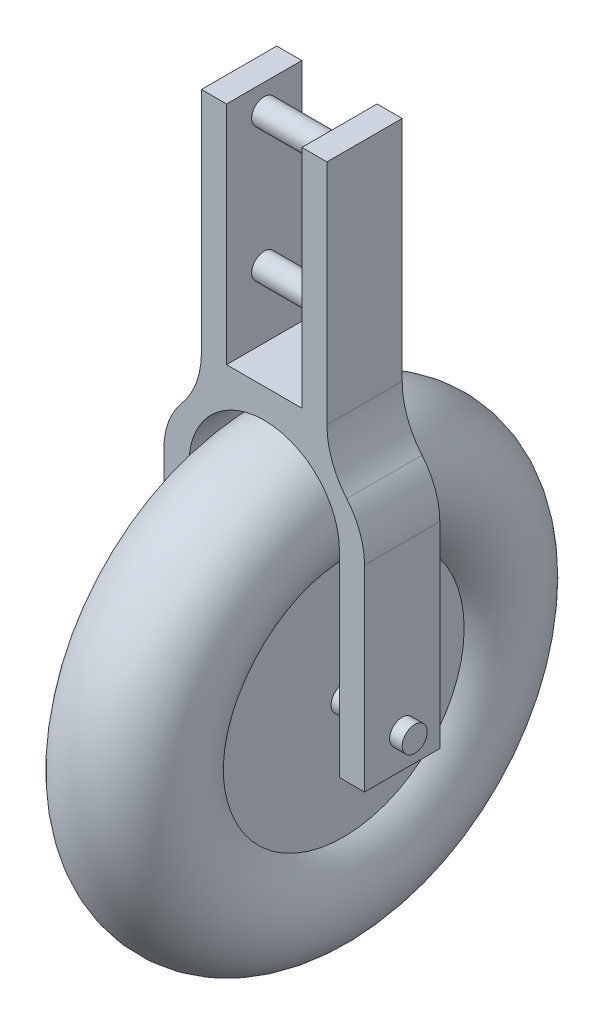
ISO-10303-21;
HEADER;
FILE_DESCRIPTION(('STEP AP214'),'2;1');
FILE_NAME('part.step','',(''),(''),'','','');
FILE_SCHEMA(('AUTOMOTIVE_DESIGN { 1 0 10303 214 1 1 1 1 }'));
ENDSEC;
DATA;
#1=APPLICATION_CONTEXT('core data for automotive mechanical design processes');
#2=APPLICATION_PROTOCOL_DEFINITION('international standard','automotive_design',2000,#1);
#3=PRODUCT_CONTEXT('',#1,'mechanical');
#4=PRODUCT('Part','Part','',(#3));
#5=PRODUCT_RELATED_PRODUCT_CATEGORY('part','',(#4));
#6=PRODUCT_DEFINITION_FORMATION('','',#4);
#7=PRODUCT_DEFINITION_CONTEXT('part definition',#1,'design');
#8=PRODUCT_DEFINITION('design','',#6,#7);
#9=PRODUCT_DEFINITION_SHAPE('','',#8);
#10=(LENGTH_UNIT() NAMED_UNIT(*) SI_UNIT(.MILLI.,.METRE.));
#11=(NAMED_UNIT(*) PLANE_ANGLE_UNIT() SI_UNIT($,.RADIAN.));
#12=(NAMED_UNIT(*) SI_UNIT($,.STERADIAN.) SOLID_ANGLE_UNIT());
#13=UNCERTAINTY_MEASURE_WITH_UNIT(LENGTH_MEASURE(1.E-05),#10,'distance_accuracy_value','');
#14=(GEOMETRIC_REPRESENTATION_CONTEXT(3) GLOBAL_UNCERTAINTY_ASSIGNED_CONTEXT((#13)) GLOBAL_UNIT_ASSIGNED_CONTEXT((#10,
#11,#12)) REPRESENTATION_CONTEXT('',''));
#15=CARTESIAN_POINT('',(0.,0.,0.));
#16=DIRECTION('',(0.,0.,1.));
#17=DIRECTION('',(1.,0.,0.));
#18=AXIS2_PLACEMENT_3D('',#15,#16,#17);
#19=CARTESIAN_POINT('',(13.5,-32.,-4.5));
#20=DIRECTION('',(-1.,0.,0.));
#21=DIRECTION('',(0.,0.,-1.));
#22=AXIS2_PLACEMENT_3D('',#19,#20,#21);
#23=CYLINDRICAL_SURFACE('',#22,1.5);
#24=CARTESIAN_POINT('',(9.,-32.,-4.5));
#25=DIRECTION('',(-1.,0.,0.));
#26=DIRECTION('',(0.,1.,0.));
#27=AXIS2_PLACEMENT_3D('',#24,#25,#26);
#28=CIRCLE('',#27,1.5);
#29=CARTESIAN_POINT('',(9.,-30.5,-4.5));
#30=VERTEX_POINT('',#29);
#31=EDGE_CURVE('E295',#30,#30,#28,.F.);
#32=ORIENTED_EDGE('',*,*,#31,.F.);
#33=EDGE_LOOP('',(#32));
#34=FACE_BOUND('',#33,.T.);
#35=CARTESIAN_POINT('',(5.,-32.,-4.5));
#36=DIRECTION('',(1.,0.,0.));
#37=DIRECTION('',(0.,0.,-1.));
#38=AXIS2_PLACEMENT_3D('',#35,#36,#37);
#39=CIRCLE('',#38,1.5);
#40=CARTESIAN_POINT('',(5.,-32.,-6.));
#41=VERTEX_POINT('',#40);
#42=EDGE_CURVE('E11',#41,#41,#39,.T.);
#43=ORIENTED_EDGE('',*,*,#42,.T.);
#44=EDGE_LOOP('',(#43));
#45=FACE_BOUND('',#44,.T.);
#46=ADVANCED_FACE('F39',(#34,#45),#23,.T.);
#47=CARTESIAN_POINT('',(-7.5,27.,-9.));
#48=DIRECTION('',(1.,0.,0.));
#49=DIRECTION('',(0.,1.,0.));
#50=AXIS2_PLACEMENT_3D('',#47,#48,#49);
#51=PLANE('',#50);
#52=DIRECTION('',(0.,-1.,0.));
#53=VECTOR('',#52,1.);
#54=CARTESIAN_POINT('',(-7.5,27.,0.));
#55=LINE('',#54,#53);
#56=CARTESIAN_POINT('',(-7.5,27.,0.));
#57=VERTEX_POINT('',#56);
#58=CARTESIAN_POINT('',(-7.5,-0.221970842191317,0.));
#59=VERTEX_POINT('',#58);
#60=EDGE_CURVE('E198',#57,#59,#55,.T.);
#61=ORIENTED_EDGE('',*,*,#60,.F.);
#62=DIRECTION('',(0.,0.,1.));
#63=VECTOR('',#62,1.);
#64=CARTESIAN_POINT('',(-7.5,27.,-9.));
#65=LINE('',#64,#63);
#66=CARTESIAN_POINT('',(-7.5,27.,-9.));
#67=VERTEX_POINT('',#66);
#68=EDGE_CURVE('E197',#67,#57,#65,.T.);
#69=ORIENTED_EDGE('',*,*,#68,.F.);
#70=DIRECTION('',(0.,-1.,0.));
#71=VECTOR('',#70,1.);
#72=CARTESIAN_POINT('',(-7.5,27.,-9.));
#73=LINE('',#72,#71);
#74=CARTESIAN_POINT('',(-7.5,-0.221970842191317,-9.));
#75=VERTEX_POINT('',#74);
#76=EDGE_CURVE('E247',#67,#75,#73,.T.);
#77=ORIENTED_EDGE('',*,*,#76,.T.);
#78=DIRECTION('',(0.,0.,1.));
#79=VECTOR('',#78,1.);
#80=CARTESIAN_POINT('',(-7.5,-0.221970842191317,-9.));
#81=LINE('',#80,#79);
#82=EDGE_CURVE('E290',#75,#59,#81,.T.);
#83=ORIENTED_EDGE('',*,*,#82,.T.);
#84=EDGE_LOOP('',(#61,#69,#77,#83));
#85=FACE_BOUND('',#84,.T.);
#86=ADVANCED_FACE('F41',(#85),#51,.F.);
#87=CARTESIAN_POINT('',(-17.5,-0.221970842191319,-9.));
#88=DIRECTION('',(0.,0.,1.));
#89=DIRECTION('',(-1.,0.,0.));
#90=AXIS2_PLACEMENT_3D('',#87,#88,#89);
#91=CYLINDRICAL_SURFACE('',#90,10.);
#92=CARTESIAN_POINT('',(-17.5,-0.221970842191319,0.));
#93=DIRECTION('',(0.,0.,-1.));
#94=DIRECTION('',(-1.,0.,0.));
#95=AXIS2_PLACEMENT_3D('',#92,#93,#94);
#96=CIRCLE('',#95,10.);
#97=CARTESIAN_POINT('',(-9.86842105263158,-6.68409145156431,0.));
#98=VERTEX_POINT('',#97);
#99=EDGE_CURVE('E200',#59,#98,#96,.T.);
#100=ORIENTED_EDGE('',*,*,#99,.F.);
#101=ORIENTED_EDGE('',*,*,#82,.F.);
#102=CARTESIAN_POINT('',(-17.5,-0.221970842191319,-9.));
#103=DIRECTION('',(0.,0.,-1.));
#104=DIRECTION('',(-1.,0.,0.));
#105=AXIS2_PLACEMENT_3D('',#102,#103,#104);
#106=CIRCLE('',#105,10.);
#107=CARTESIAN_POINT('',(-9.86842105263158,-6.68409145156431,-9.));
#108=VERTEX_POINT('',#107);
#109=EDGE_CURVE('E126',#75,#108,#106,.T.);
#110=ORIENTED_EDGE('',*,*,#109,.T.);
#111=DIRECTION('',(0.,0.,1.));
#112=VECTOR('',#111,1.);
#113=CARTESIAN_POINT('',(-9.86842105263158,-6.68409145156431,-9.));
#114=LINE('',#113,#112);
#115=EDGE_CURVE('E287',#108,#98,#114,.T.);
#116=ORIENTED_EDGE('',*,*,#115,.T.);
#117=EDGE_LOOP('',(#100,#101,#110,#116));
#118=FACE_BOUND('',#117,.T.);
#119=ADVANCED_FACE('F408',(#118),#91,.F.);
#120=CARTESIAN_POINT('',(-3.,-12.5,-9.));
#121=DIRECTION('',(0.,0.,1.));
#122=DIRECTION('',(-1.,0.,0.));
#123=AXIS2_PLACEMENT_3D('',#120,#121,#122);
#124=CYLINDRICAL_SURFACE('',#123,9.);
#125=CARTESIAN_POINT('',(-3.,-12.5,0.));
#126=DIRECTION('',(0.,0.,1.));
#127=DIRECTION('',(-1.,0.,0.));
#128=AXIS2_PLACEMENT_3D('',#125,#126,#127);
#129=CIRCLE('',#128,9.);
#130=CARTESIAN_POINT('',(-12.,-12.5,0.));
#131=VERTEX_POINT('',#130);
#132=EDGE_CURVE('E204',#98,#131,#129,.T.);
#133=ORIENTED_EDGE('',*,*,#132,.F.);
#134=ORIENTED_EDGE('',*,*,#115,.F.);
#135=CARTESIAN_POINT('',(-3.,-12.5,-9.));
#136=DIRECTION('',(0.,0.,1.));
#137=DIRECTION('',(-1.,0.,0.));
#138=AXIS2_PLACEMENT_3D('',#135,#136,#137);
#139=CIRCLE('',#138,9.);
#140=CARTESIAN_POINT('',(-12.,-12.5,-9.));
#141=VERTEX_POINT('',#140);
#142=EDGE_CURVE('E334',#108,#141,#139,.T.);
#143=ORIENTED_EDGE('',*,*,#142,.T.);
#144=DIRECTION('',(0.,0.,1.));
#145=VECTOR('',#144,1.);
#146=CARTESIAN_POINT('',(-12.,-12.5,-9.));
#147=LINE('',#146,#145);
#148=EDGE_CURVE('E284',#141,#131,#147,.T.);
#149=ORIENTED_EDGE('',*,*,#148,.T.);
#150=EDGE_LOOP('',(#133,#134,#143,#149));
#151=FACE_BOUND('',#150,.T.);
#152=ADVANCED_FACE('F406',(#151),#124,.T.);
#153=CARTESIAN_POINT('',(-12.,-36.,-9.));
#154=DIRECTION('',(1.,0.,0.));
#155=DIRECTION('',(0.,0.,1.));
#156=AXIS2_PLACEMENT_3D('',#153,#154,#155);
#157=PLANE('',#156);
#158=CARTESIAN_POINT('',(-12.,-32.,-4.5));
#159=DIRECTION('',(-1.,0.,0.));
#160=DIRECTION('',(0.,0.,1.));
#161=AXIS2_PLACEMENT_3D('',#158,#159,#160);
#162=CIRCLE('',#161,1.5);
#163=CARTESIAN_POINT('',(-12.,-32.,-3.));
#164=VERTEX_POINT('',#163);
#165=EDGE_CURVE('E49',#164,#164,#162,.F.);
#166=ORIENTED_EDGE('',*,*,#165,.T.);
#167=EDGE_LOOP('',(#166));
#168=FACE_BOUND('',#167,.T.);
#169=DIRECTION('',(0.,-1.,0.));
#170=VECTOR('',#169,1.);
#171=CARTESIAN_POINT('',(-12.,-36.,0.));
#172=LINE('',#171,#170);
#173=CARTESIAN_POINT('',(-12.,-36.,0.));
#174=VERTEX_POINT('',#173);
#175=EDGE_CURVE('E207',#131,#174,#172,.T.);
#176=ORIENTED_EDGE('',*,*,#175,.F.);
#177=ORIENTED_EDGE('',*,*,#148,.F.);
#178=DIRECTION('',(0.,-1.,0.));
#179=VECTOR('',#178,1.);
#180=CARTESIAN_POINT('',(-12.,-36.,-9.));
#181=LINE('',#180,#179);
#182=CARTESIAN_POINT('',(-12.,-36.,-9.));
#183=VERTEX_POINT('',#182);
#184=EDGE_CURVE('E337',#141,#183,#181,.T.);
#185=ORIENTED_EDGE('',*,*,#184,.T.);
#186=DIRECTION('',(0.,0.,1.));
#187=VECTOR('',#186,1.);
#188=CARTESIAN_POINT('',(-12.,-36.,-9.));
#189=LINE('',#188,#187);
#190=EDGE_CURVE('E281',#183,#174,#189,.T.);
#191=ORIENTED_EDGE('',*,*,#190,.T.);
#192=EDGE_LOOP('',(#176,#177,#185,#191));
#193=FACE_BOUND('',#192,.T.);
#194=ADVANCED_FACE('F403',(#168,#193),#157,.F.);
#195=CARTESIAN_POINT('',(-12.,-36.,-9.));
#196=DIRECTION('',(0.,1.,0.));
#197=DIRECTION('',(0.,0.,-1.));
#198=AXIS2_PLACEMENT_3D('',#195,#196,#197);
#199=PLANE('',#198);
#200=DIRECTION('',(1.,0.,0.));
#201=VECTOR('',#200,1.);
#202=CARTESIAN_POINT('',(-12.,-36.,0.));
#203=LINE('',#202,#201);
#204=CARTESIAN_POINT('',(-9.,-36.,0.));
#205=VERTEX_POINT('',#204);
#206=EDGE_CURVE('E210',#174,#205,#203,.T.);
#207=ORIENTED_EDGE('',*,*,#206,.F.);
#208=ORIENTED_EDGE('',*,*,#190,.F.);
#209=DIRECTION('',(1.,0.,0.));
#210=VECTOR('',#209,1.);
#211=CARTESIAN_POINT('',(-12.,-36.,-9.));
#212=LINE('',#211,#210);
#213=CARTESIAN_POINT('',(-9.,-36.,-9.));
#214=VERTEX_POINT('',#213);
#215=EDGE_CURVE('E340',#183,#214,#212,.T.);
#216=ORIENTED_EDGE('',*,*,#215,.T.);
#217=DIRECTION('',(0.,0.,1.));
#218=VECTOR('',#217,1.);
#219=CARTESIAN_POINT('',(-9.,-36.,-9.));
#220=LINE('',#219,#218);
#221=EDGE_CURVE('E278',#214,#205,#220,.T.);
#222=ORIENTED_EDGE('',*,*,#221,.T.);
#223=EDGE_LOOP('',(#207,#208,#216,#222));
#224=FACE_BOUND('',#223,.T.);
#225=ADVANCED_FACE('F401',(#224),#199,.F.);
#226=CARTESIAN_POINT('',(-9.,-36.,-9.));
#227=DIRECTION('',(-1.,0.,0.));
#228=DIRECTION('',(0.,-1.,0.));
#229=AXIS2_PLACEMENT_3D('',#226,#227,#228);
#230=PLANE('',#229);
#231=CARTESIAN_POINT('',(-9.,-32.,-4.5));
#232=DIRECTION('',(1.,0.,0.));
#233=DIRECTION('',(0.,-1.,0.));
#234=AXIS2_PLACEMENT_3D('',#231,#232,#233);
#235=CIRCLE('',#234,1.5);
#236=CARTESIAN_POINT('',(-9.,-33.5,-4.5));
#237=VERTEX_POINT('',#236);
#238=EDGE_CURVE('E326',#237,#237,#235,.F.);
#239=ORIENTED_EDGE('',*,*,#238,.T.);
#240=EDGE_LOOP('',(#239));
#241=FACE_BOUND('',#240,.T.);
#242=DIRECTION('',(0.,1.,0.));
#243=VECTOR('',#242,1.);
#244=CARTESIAN_POINT('',(-9.,-36.,0.));
#245=LINE('',#244,#243);
#246=CARTESIAN_POINT('',(-9.,-12.5,0.));
#247=VERTEX_POINT('',#246);
#248=EDGE_CURVE('E213',#205,#247,#245,.T.);
#249=ORIENTED_EDGE('',*,*,#248,.F.);
#250=ORIENTED_EDGE('',*,*,#221,.F.);
#251=DIRECTION('',(0.,1.,0.));
#252=VECTOR('',#251,1.);
#253=CARTESIAN_POINT('',(-9.,-36.,-9.));
#254=LINE('',#253,#252);
#255=CARTESIAN_POINT('',(-9.,-12.5,-9.));
#256=VERTEX_POINT('',#255);
#257=EDGE_CURVE('E343',#214,#256,#254,.T.);
#258=ORIENTED_EDGE('',*,*,#257,.T.);
#259=DIRECTION('',(0.,0.,1.));
#260=VECTOR('',#259,1.);
#261=CARTESIAN_POINT('',(-9.,-12.5,-9.));
#262=LINE('',#261,#260);
#263=EDGE_CURVE('E275',#256,#247,#262,.T.);
#264=ORIENTED_EDGE('',*,*,#263,.T.);
#265=EDGE_LOOP('',(#249,#250,#258,#264));
#266=FACE_BOUND('',#265,.T.);
#267=ADVANCED_FACE('F397',(#241,#266),#230,.F.);
#268=CARTESIAN_POINT('',(0.,-12.5,-9.));
#269=DIRECTION('',(0.,0.,1.));
#270=DIRECTION('',(-1.,0.,0.));
#271=AXIS2_PLACEMENT_3D('',#268,#269,#270);
#272=CYLINDRICAL_SURFACE('',#271,9.);
#273=CARTESIAN_POINT('',(0.,-12.5,0.));
#274=DIRECTION('',(0.,0.,-1.));
#275=DIRECTION('',(1.,0.,0.));
#276=AXIS2_PLACEMENT_3D('',#273,#274,#275);
#277=CIRCLE('',#276,9.);
#278=CARTESIAN_POINT('',(9.,-12.5,0.));
#279=VERTEX_POINT('',#278);
#280=EDGE_CURVE('E216',#247,#279,#277,.T.);
#281=ORIENTED_EDGE('',*,*,#280,.F.);
#282=ORIENTED_EDGE('',*,*,#263,.F.);
#283=CARTESIAN_POINT('',(0.,-12.5,-9.));
#284=DIRECTION('',(0.,0.,-1.));
#285=DIRECTION('',(-1.,0.,0.));
#286=AXIS2_PLACEMENT_3D('',#283,#284,#285);
#287=CIRCLE('',#286,9.);
#288=CARTESIAN_POINT('',(9.,-12.5,-9.));
#289=VERTEX_POINT('',#288);
#290=EDGE_CURVE('E346',#256,#289,#287,.T.);
#291=ORIENTED_EDGE('',*,*,#290,.T.);
#292=DIRECTION('',(0.,0.,1.));
#293=VECTOR('',#292,1.);
#294=CARTESIAN_POINT('',(9.,-12.5,-9.));
#295=LINE('',#294,#293);
#296=EDGE_CURVE('E272',#289,#279,#295,.T.);
#297=ORIENTED_EDGE('',*,*,#296,.T.);
#298=EDGE_LOOP('',(#281,#282,#291,#297));
#299=FACE_BOUND('',#298,.T.);
#300=ADVANCED_FACE('F394',(#299),#272,.F.);
#301=CARTESIAN_POINT('',(9.,-36.,-9.));
#302=DIRECTION('',(1.,0.,0.));
#303=DIRECTION('',(0.,1.,0.));
#304=AXIS2_PLACEMENT_3D('',#301,#302,#303);
#305=PLANE('',#304);
#306=ORIENTED_EDGE('',*,*,#31,.T.);
#307=EDGE_LOOP('',(#306));
#308=FACE_BOUND('',#307,.T.);
#309=DIRECTION('',(0.,-1.,0.));
#310=VECTOR('',#309,1.);
#311=CARTESIAN_POINT('',(9.,-36.,0.));
#312=LINE('',#311,#310);
#313=CARTESIAN_POINT('',(9.,-36.,0.));
#314=VERTEX_POINT('',#313);
#315=EDGE_CURVE('E219',#279,#314,#312,.T.);
#316=ORIENTED_EDGE('',*,*,#315,.F.);
#317=ORIENTED_EDGE('',*,*,#296,.F.);
#318=DIRECTION('',(0.,-1.,0.));
#319=VECTOR('',#318,1.);
#320=CARTESIAN_POINT('',(9.,-36.,-9.));
#321=LINE('',#320,#319);
#322=CARTESIAN_POINT('',(9.,-36.,-9.));
#323=VERTEX_POINT('',#322);
#324=EDGE_CURVE('E349',#289,#323,#321,.T.);
#325=ORIENTED_EDGE('',*,*,#324,.T.);
#326=DIRECTION('',(0.,0.,1.));
#327=VECTOR('',#326,1.);
#328=CARTESIAN_POINT('',(9.,-36.,-9.));
#329=LINE('',#328,#327);
#330=EDGE_CURVE('E269',#323,#314,#329,.T.);
#331=ORIENTED_EDGE('',*,*,#330,.T.);
#332=EDGE_LOOP('',(#316,#317,#325,#331));
#333=FACE_BOUND('',#332,.T.);
#334=ADVANCED_FACE('F392',(#308,#333),#305,.F.);
#335=CARTESIAN_POINT('',(12.,-36.,-9.));
#336=DIRECTION('',(0.,1.,0.));
#337=DIRECTION('',(0.,0.,-1.));
#338=AXIS2_PLACEMENT_3D('',#335,#336,#337);
#339=PLANE('',#338);
#340=DIRECTION('',(1.,0.,0.));
#341=VECTOR('',#340,1.);
#342=CARTESIAN_POINT('',(12.,-36.,0.));
#343=LINE('',#342,#341);
#344=CARTESIAN_POINT('',(12.,-36.,0.));
#345=VERTEX_POINT('',#344);
#346=EDGE_CURVE('E222',#314,#345,#343,.T.);
#347=ORIENTED_EDGE('',*,*,#346,.F.);
#348=ORIENTED_EDGE('',*,*,#330,.F.);
#349=DIRECTION('',(1.,0.,0.));
#350=VECTOR('',#349,1.);
#351=CARTESIAN_POINT('',(12.,-36.,-9.));
#352=LINE('',#351,#350);
#353=CARTESIAN_POINT('',(12.,-36.,-9.));
#354=VERTEX_POINT('',#353);
#355=EDGE_CURVE('E352',#323,#354,#352,.T.);
#356=ORIENTED_EDGE('',*,*,#355,.T.);
#357=DIRECTION('',(0.,0.,1.));
#358=VECTOR('',#357,1.);
#359=CARTESIAN_POINT('',(12.,-36.,-9.));
#360=LINE('',#359,#358);
#361=EDGE_CURVE('E266',#354,#345,#360,.T.);
#362=ORIENTED_EDGE('',*,*,#361,.T.);
#363=EDGE_LOOP('',(#347,#348,#356,#362));
#364=FACE_BOUND('',#363,.T.);
#365=ADVANCED_FACE('F388',(#364),#339,.F.);
#366=CARTESIAN_POINT('',(12.,-36.,-9.));
#367=DIRECTION('',(-1.,0.,0.));
#368=DIRECTION('',(0.,0.,-1.));
#369=AXIS2_PLACEMENT_3D('',#366,#367,#368);
#370=PLANE('',#369);
#371=CARTESIAN_POINT('',(12.,-32.,-4.5));
#372=DIRECTION('',(1.,0.,0.));
#373=DIRECTION('',(0.,0.,-1.));
#374=AXIS2_PLACEMENT_3D('',#371,#372,#373);
#375=CIRCLE('',#374,1.5);
#376=CARTESIAN_POINT('',(12.,-32.,-6.));
#377=VERTEX_POINT('',#376);
#378=EDGE_CURVE('E293',#377,#377,#375,.F.);
#379=ORIENTED_EDGE('',*,*,#378,.T.);
#380=EDGE_LOOP('',(#379));
#381=FACE_BOUND('',#380,.T.);
#382=DIRECTION('',(0.,1.,0.));
#383=VECTOR('',#382,1.);
#384=CARTESIAN_POINT('',(12.,-36.,0.));
#385=LINE('',#384,#383);
#386=CARTESIAN_POINT('',(12.,-12.5,0.));
#387=VERTEX_POINT('',#386);
#388=EDGE_CURVE('E225',#345,#387,#385,.T.);
#389=ORIENTED_EDGE('',*,*,#388,.F.);
#390=ORIENTED_EDGE('',*,*,#361,.F.);
#391=DIRECTION('',(0.,1.,0.));
#392=VECTOR('',#391,1.);
#393=CARTESIAN_POINT('',(12.,-36.,-9.));
#394=LINE('',#393,#392);
#395=CARTESIAN_POINT('',(12.,-12.5,-9.));
#396=VERTEX_POINT('',#395);
#397=EDGE_CURVE('E355',#354,#396,#394,.T.);
#398=ORIENTED_EDGE('',*,*,#397,.T.);
#399=DIRECTION('',(0.,0.,1.));
#400=VECTOR('',#399,1.);
#401=CARTESIAN_POINT('',(12.,-12.5,-9.));
#402=LINE('',#401,#400);
#403=EDGE_CURVE('E263',#396,#387,#402,.T.);
#404=ORIENTED_EDGE('',*,*,#403,.T.);
#405=EDGE_LOOP('',(#389,#390,#398,#404));
#406=FACE_BOUND('',#405,.T.);
#407=ADVANCED_FACE('F385',(#381,#406),#370,.F.);
#408=CARTESIAN_POINT('',(3.,-12.5,-9.));
#409=DIRECTION('',(0.,0.,1.));
#410=DIRECTION('',(-1.,0.,0.));
#411=AXIS2_PLACEMENT_3D('',#408,#409,#410);
#412=CYLINDRICAL_SURFACE('',#411,9.);
#413=CARTESIAN_POINT('',(3.,-12.5,0.));
#414=DIRECTION('',(0.,0.,1.));
#415=DIRECTION('',(1.,0.,0.));
#416=AXIS2_PLACEMENT_3D('',#413,#414,#415);
#417=CIRCLE('',#416,9.);
#418=CARTESIAN_POINT('',(9.86842105263158,-6.68409145156431,0.));
#419=VERTEX_POINT('',#418);
#420=EDGE_CURVE('E228',#387,#419,#417,.T.);
#421=ORIENTED_EDGE('',*,*,#420,.F.);
#422=ORIENTED_EDGE('',*,*,#403,.F.);
#423=CARTESIAN_POINT('',(3.,-12.5,-9.));
#424=DIRECTION('',(0.,0.,1.));
#425=DIRECTION('',(1.,0.,0.));
#426=AXIS2_PLACEMENT_3D('',#423,#424,#425);
#427=CIRCLE('',#426,9.);
#428=CARTESIAN_POINT('',(9.86842105263158,-6.68409145156431,-9.));
#429=VERTEX_POINT('',#428);
#430=EDGE_CURVE('E358',#396,#429,#427,.T.);
#431=ORIENTED_EDGE('',*,*,#430,.T.);
#432=DIRECTION('',(0.,0.,1.));
#433=VECTOR('',#432,1.);
#434=CARTESIAN_POINT('',(9.86842105263158,-6.68409145156431,-9.));
#435=LINE('',#434,#433);
#436=EDGE_CURVE('E260',#429,#419,#435,.T.);
#437=ORIENTED_EDGE('',*,*,#436,.T.);
#438=EDGE_LOOP('',(#421,#422,#431,#437));
#439=FACE_BOUND('',#438,.T.);
#440=ADVANCED_FACE('F383',(#439),#412,.T.);
#441=CARTESIAN_POINT('',(17.5,-0.221970842191319,-9.));
#442=DIRECTION('',(0.,0.,1.));
#443=DIRECTION('',(-1.,0.,0.));
#444=AXIS2_PLACEMENT_3D('',#441,#442,#443);
#445=CYLINDRICAL_SURFACE('',#444,10.);
#446=CARTESIAN_POINT('',(17.5,-0.221970842191319,0.));
#447=DIRECTION('',(0.,0.,-1.));
#448=DIRECTION('',(1.,0.,0.));
#449=AXIS2_PLACEMENT_3D('',#446,#447,#448);
#450=CIRCLE('',#449,10.);
#451=CARTESIAN_POINT('',(7.5,-0.221970842191317,0.));
#452=VERTEX_POINT('',#451);
#453=EDGE_CURVE('E231',#419,#452,#450,.T.);
#454=ORIENTED_EDGE('',*,*,#453,.F.);
#455=ORIENTED_EDGE('',*,*,#436,.F.);
#456=CARTESIAN_POINT('',(17.5,-0.221970842191319,-9.));
#457=DIRECTION('',(0.,0.,-1.));
#458=DIRECTION('',(1.,0.,0.));
#459=AXIS2_PLACEMENT_3D('',#456,#457,#458);
#460=CIRCLE('',#459,10.);
#461=CARTESIAN_POINT('',(7.5,-0.221970842191317,-9.));
#462=VERTEX_POINT('',#461);
#463=EDGE_CURVE('E361',#429,#462,#460,.T.);
#464=ORIENTED_EDGE('',*,*,#463,.T.);
#465=DIRECTION('',(0.,0.,1.));
#466=VECTOR('',#465,1.);
#467=CARTESIAN_POINT('',(7.5,-0.221970842191317,-9.));
#468=LINE('',#467,#466);
#469=EDGE_CURVE('E257',#462,#452,#468,.T.);
#470=ORIENTED_EDGE('',*,*,#469,.T.);
#471=EDGE_LOOP('',(#454,#455,#464,#470));
#472=FACE_BOUND('',#471,.T.);
#473=ADVANCED_FACE('F379',(#472),#445,.F.);
#474=CARTESIAN_POINT('',(7.5,27.,-9.));
#475=DIRECTION('',(-1.,0.,0.));
#476=DIRECTION('',(0.,-1.,0.));
#477=AXIS2_PLACEMENT_3D('',#474,#475,#476);
#478=PLANE('',#477);
#479=DIRECTION('',(0.,1.,0.));
#480=VECTOR('',#479,1.);
#481=CARTESIAN_POINT('',(7.5,27.,0.));
#482=LINE('',#481,#480);
#483=CARTESIAN_POINT('',(7.5,27.,0.));
#484=VERTEX_POINT('',#483);
#485=EDGE_CURVE('E234',#452,#484,#482,.T.);
#486=ORIENTED_EDGE('',*,*,#485,.F.);
#487=ORIENTED_EDGE('',*,*,#469,.F.);
#488=DIRECTION('',(0.,1.,0.));
#489=VECTOR('',#488,1.);
#490=CARTESIAN_POINT('',(7.5,27.,-9.));
#491=LINE('',#490,#489);
#492=CARTESIAN_POINT('',(7.5,27.,-9.));
#493=VERTEX_POINT('',#492);
#494=EDGE_CURVE('E364',#462,#493,#491,.T.);
#495=ORIENTED_EDGE('',*,*,#494,.T.);
#496=DIRECTION('',(0.,0.,1.));
#497=VECTOR('',#496,1.);
#498=CARTESIAN_POINT('',(7.5,27.,-9.));
#499=LINE('',#498,#497);
#500=EDGE_CURVE('E254',#493,#484,#499,.T.);
#501=ORIENTED_EDGE('',*,*,#500,.T.);
#502=EDGE_LOOP('',(#486,#487,#495,#501));
#503=FACE_BOUND('',#502,.T.);
#504=ADVANCED_FACE('F376',(#503),#478,.F.);
#505=CARTESIAN_POINT('',(7.5,27.,-9.));
#506=DIRECTION('',(0.,-1.,0.));
#507=DIRECTION('',(1.,0.,0.));
#508=AXIS2_PLACEMENT_3D('',#505,#506,#507);
#509=PLANE('',#508);
#510=DIRECTION('',(-1.,0.,0.));
#511=VECTOR('',#510,1.);
#512=CARTESIAN_POINT('',(7.5,27.,0.));
#513=LINE('',#512,#511);
#514=CARTESIAN_POINT('',(4.5,27.,0.));
#515=VERTEX_POINT('',#514);
#516=EDGE_CURVE('E237',#484,#515,#513,.T.);
#517=ORIENTED_EDGE('',*,*,#516,.F.);
#518=ORIENTED_EDGE('',*,*,#500,.F.);
#519=DIRECTION('',(-1.,0.,0.));
#520=VECTOR('',#519,1.);
#521=CARTESIAN_POINT('',(7.5,27.,-9.));
#522=LINE('',#521,#520);
#523=CARTESIAN_POINT('',(4.5,27.,-9.));
#524=VERTEX_POINT('',#523);
#525=EDGE_CURVE('E192',#493,#524,#522,.T.);
#526=ORIENTED_EDGE('',*,*,#525,.T.);
#527=DIRECTION('',(0.,0.,1.));
#528=VECTOR('',#527,1.);
#529=CARTESIAN_POINT('',(4.5,27.,-9.));
#530=LINE('',#529,#528);
#531=EDGE_CURVE('E251',#524,#515,#530,.T.);
#532=ORIENTED_EDGE('',*,*,#531,.T.);
#533=EDGE_LOOP('',(#517,#518,#526,#532));
#534=FACE_BOUND('',#533,.T.);
#535=ADVANCED_FACE('F369',(#534),#509,.F.);
#536=CARTESIAN_POINT('',(4.5,27.,-9.));
#537=DIRECTION('',(1.,0.,0.));
#538=DIRECTION('',(0.,1.,0.));
#539=AXIS2_PLACEMENT_3D('',#536,#537,#538);
#540=PLANE('',#539);
#541=CARTESIAN_POINT('',(4.5,7.99999999999999,-4.5));
#542=DIRECTION('',(-1.,0.,0.));
#543=DIRECTION('',(0.,1.,0.));
#544=AXIS2_PLACEMENT_3D('',#541,#542,#543);
#545=CIRCLE('',#544,1.5);
#546=CARTESIAN_POINT('',(4.5,9.49999999999999,-4.5));
#547=VERTEX_POINT('',#546);
#548=EDGE_CURVE('E304',#547,#547,#545,.T.);
#549=ORIENTED_EDGE('',*,*,#548,.F.);
#550=EDGE_LOOP('',(#549));
#551=FACE_BOUND('',#550,.T.);
#552=CARTESIAN_POINT('',(4.5,24.,-4.5));
#553=DIRECTION('',(-1.,0.,0.));
#554=DIRECTION('',(0.,1.,0.));
#555=AXIS2_PLACEMENT_3D('',#552,#553,#554);
#556=CIRCLE('',#555,1.5);
#557=CARTESIAN_POINT('',(4.5,25.5,-4.5));
#558=VERTEX_POINT('',#557);
#559=EDGE_CURVE('E303',#558,#558,#556,.T.);
#560=ORIENTED_EDGE('',*,*,#559,.F.);
#561=EDGE_LOOP('',(#560));
#562=FACE_BOUND('',#561,.T.);
#563=DIRECTION('',(0.,-1.,0.));
#564=VECTOR('',#563,1.);
#565=CARTESIAN_POINT('',(4.5,27.,0.));
#566=LINE('',#565,#564);
#567=CARTESIAN_POINT('',(4.5,0.,0.));
#568=VERTEX_POINT('',#567);
#569=EDGE_CURVE('E240',#515,#568,#566,.T.);
#570=ORIENTED_EDGE('',*,*,#569,.F.);
#571=ORIENTED_EDGE('',*,*,#531,.F.);
#572=DIRECTION('',(0.,-1.,0.));
#573=VECTOR('',#572,1.);
#574=CARTESIAN_POINT('',(4.5,27.,-9.));
#575=LINE('',#574,#573);
#576=CARTESIAN_POINT('',(4.5,0.,-9.));
#577=VERTEX_POINT('',#576);
#578=EDGE_CURVE('E190',#524,#577,#575,.T.);
#579=ORIENTED_EDGE('',*,*,#578,.T.);
#580=DIRECTION('',(0.,0.,1.));
#581=VECTOR('',#580,1.);
#582=CARTESIAN_POINT('',(4.5,0.,-9.));
#583=LINE('',#582,#581);
#584=EDGE_CURVE('E184',#577,#568,#583,.T.);
#585=ORIENTED_EDGE('',*,*,#584,.T.);
#586=EDGE_LOOP('',(#570,#571,#579,#585));
#587=FACE_BOUND('',#586,.T.);
#588=ADVANCED_FACE('F373',(#551,#562,#587),#540,.F.);
#589=CARTESIAN_POINT('',(-4.5,0.,-9.));
#590=DIRECTION('',(0.,-1.,0.));
#591=DIRECTION('',(0.,0.,1.));
#592=AXIS2_PLACEMENT_3D('',#589,#590,#591);
#593=PLANE('',#592);
#594=DIRECTION('',(-1.,0.,0.));
#595=VECTOR('',#594,1.);
#596=CARTESIAN_POINT('',(-4.5,0.,0.));
#597=LINE('',#596,#595);
#598=CARTESIAN_POINT('',(-4.5,0.,0.));
#599=VERTEX_POINT('',#598);
#600=EDGE_CURVE('E243',#568,#599,#597,.T.);
#601=ORIENTED_EDGE('',*,*,#600,.F.);
#602=ORIENTED_EDGE('',*,*,#584,.F.);
#603=DIRECTION('',(-1.,0.,0.));
#604=VECTOR('',#603,1.);
#605=CARTESIAN_POINT('',(-4.5,0.,-9.));
#606=LINE('',#605,#604);
#607=CARTESIAN_POINT('',(-4.5,0.,-9.));
#608=VERTEX_POINT('',#607);
#609=EDGE_CURVE('E174',#577,#608,#606,.T.);
#610=ORIENTED_EDGE('',*,*,#609,.T.);
#611=DIRECTION('',(0.,0.,1.));
#612=VECTOR('',#611,1.);
#613=CARTESIAN_POINT('',(-4.5,0.,-9.));
#614=LINE('',#613,#612);
#615=EDGE_CURVE('E179',#608,#599,#614,.T.);
#616=ORIENTED_EDGE('',*,*,#615,.T.);
#617=EDGE_LOOP('',(#601,#602,#610,#616));
#618=FACE_BOUND('',#617,.T.);
#619=ADVANCED_FACE('F187',(#618),#593,.F.);
#620=CARTESIAN_POINT('',(-4.5,27.,-9.));
#621=DIRECTION('',(-1.,0.,0.));
#622=DIRECTION('',(0.,-1.,0.));
#623=AXIS2_PLACEMENT_3D('',#620,#621,#622);
#624=PLANE('',#623);
#625=CARTESIAN_POINT('',(-4.5,8.,-4.5));
#626=DIRECTION('',(1.,0.,0.));
#627=DIRECTION('',(0.,-1.,0.));
#628=AXIS2_PLACEMENT_3D('',#625,#626,#627);
#629=CIRCLE('',#628,1.5);
#630=CARTESIAN_POINT('',(-4.5,6.5,-4.5));
#631=VERTEX_POINT('',#630);
#632=EDGE_CURVE('E43',#631,#631,#629,.T.);
#633=ORIENTED_EDGE('',*,*,#632,.F.);
#634=EDGE_LOOP('',(#633));
#635=FACE_BOUND('',#634,.T.);
#636=CARTESIAN_POINT('',(-4.5,24.,-4.5));
#637=DIRECTION('',(1.,0.,0.));
#638=DIRECTION('',(0.,-1.,0.));
#639=AXIS2_PLACEMENT_3D('',#636,#637,#638);
#640=CIRCLE('',#639,1.5);
#641=CARTESIAN_POINT('',(-4.5,22.5,-4.5));
#642=VERTEX_POINT('',#641);
#643=EDGE_CURVE('E301',#642,#642,#640,.T.);
#644=ORIENTED_EDGE('',*,*,#643,.F.);
#645=EDGE_LOOP('',(#644));
#646=FACE_BOUND('',#645,.T.);
#647=DIRECTION('',(0.,1.,0.));
#648=VECTOR('',#647,1.);
#649=CARTESIAN_POINT('',(-4.5,27.,0.));
#650=LINE('',#649,#648);
#651=CARTESIAN_POINT('',(-4.5,27.,0.));
#652=VERTEX_POINT('',#651);
#653=EDGE_CURVE('E181',#599,#652,#650,.T.);
#654=ORIENTED_EDGE('',*,*,#653,.F.);
#655=ORIENTED_EDGE('',*,*,#615,.F.);
#656=DIRECTION('',(0.,1.,0.));
#657=VECTOR('',#656,1.);
#658=CARTESIAN_POINT('',(-4.5,27.,-9.));
#659=LINE('',#658,#657);
#660=CARTESIAN_POINT('',(-4.5,27.,-9.));
#661=VERTEX_POINT('',#660);
#662=EDGE_CURVE('E170',#608,#661,#659,.T.);
#663=ORIENTED_EDGE('',*,*,#662,.T.);
#664=DIRECTION('',(0.,0.,1.));
#665=VECTOR('',#664,1.);
#666=CARTESIAN_POINT('',(-4.5,27.,-9.));
#667=LINE('',#666,#665);
#668=EDGE_CURVE('E185',#661,#652,#667,.T.);
#669=ORIENTED_EDGE('',*,*,#668,.T.);
#670=EDGE_LOOP('',(#654,#655,#663,#669));
#671=FACE_BOUND('',#670,.T.);
#672=ADVANCED_FACE('F180',(#635,#646,#671),#624,.F.);
#673=CARTESIAN_POINT('',(-7.5,27.,-9.));
#674=DIRECTION('',(0.,-1.,0.));
#675=DIRECTION('',(1.,0.,0.));
#676=AXIS2_PLACEMENT_3D('',#673,#674,#675);
#677=PLANE('',#676);
#678=DIRECTION('',(-1.,0.,0.));
#679=VECTOR('',#678,1.);
#680=CARTESIAN_POINT('',(-7.5,27.,0.));
#681=LINE('',#680,#679);
#682=EDGE_CURVE('E114',#652,#57,#681,.T.);
#683=ORIENTED_EDGE('',*,*,#682,.F.);
#684=ORIENTED_EDGE('',*,*,#668,.F.);
#685=DIRECTION('',(-1.,0.,0.));
#686=VECTOR('',#685,1.);
#687=CARTESIAN_POINT('',(-7.5,27.,-9.));
#688=LINE('',#687,#686);
#689=EDGE_CURVE('E58',#661,#67,#688,.T.);
#690=ORIENTED_EDGE('',*,*,#689,.T.);
#691=ORIENTED_EDGE('',*,*,#68,.T.);
#692=EDGE_LOOP('',(#683,#684,#690,#691));
#693=FACE_BOUND('',#692,.T.);
#694=ADVANCED_FACE('F412',(#693),#677,.F.);
#695=CARTESIAN_POINT('',(-17.5,-0.221970842191319,-9.));
#696=DIRECTION('',(0.,0.,1.));
#697=DIRECTION('',(-1.,0.,0.));
#698=AXIS2_PLACEMENT_3D('',#695,#696,#697);
#699=PLANE('',#698);
#700=ORIENTED_EDGE('',*,*,#76,.F.);
#701=ORIENTED_EDGE('',*,*,#689,.F.);
#702=ORIENTED_EDGE('',*,*,#662,.F.);
#703=ORIENTED_EDGE('',*,*,#609,.F.);
#704=ORIENTED_EDGE('',*,*,#578,.F.);
#705=ORIENTED_EDGE('',*,*,#525,.F.);
#706=ORIENTED_EDGE('',*,*,#494,.F.);
#707=ORIENTED_EDGE('',*,*,#463,.F.);
#708=ORIENTED_EDGE('',*,*,#430,.F.);
#709=ORIENTED_EDGE('',*,*,#397,.F.);
#710=ORIENTED_EDGE('',*,*,#355,.F.);
#711=ORIENTED_EDGE('',*,*,#324,.F.);
#712=ORIENTED_EDGE('',*,*,#290,.F.);
#713=ORIENTED_EDGE('',*,*,#257,.F.);
#714=ORIENTED_EDGE('',*,*,#215,.F.);
#715=ORIENTED_EDGE('',*,*,#184,.F.);
#716=ORIENTED_EDGE('',*,*,#142,.F.);
#717=ORIENTED_EDGE('',*,*,#109,.F.);
#718=EDGE_LOOP('',(#700,#701,#702,#703,#704,#705,#706,#707,#708,#709,#710,#711,#712,#713,#714,
#715,#716,#717));
#719=FACE_BOUND('',#718,.T.);
#720=ADVANCED_FACE('F172',(#719),#699,.F.);
#721=CARTESIAN_POINT('',(-17.5,-0.221970842191319,0.));
#722=DIRECTION('',(0.,0.,1.));
#723=DIRECTION('',(-1.,0.,0.));
#724=AXIS2_PLACEMENT_3D('',#721,#722,#723);
#725=PLANE('',#724);
#726=ORIENTED_EDGE('',*,*,#60,.T.);
#727=ORIENTED_EDGE('',*,*,#99,.T.);
#728=ORIENTED_EDGE('',*,*,#132,.T.);
#729=ORIENTED_EDGE('',*,*,#175,.T.);
#730=ORIENTED_EDGE('',*,*,#206,.T.);
#731=ORIENTED_EDGE('',*,*,#248,.T.);
#732=ORIENTED_EDGE('',*,*,#280,.T.);
#733=ORIENTED_EDGE('',*,*,#315,.T.);
#734=ORIENTED_EDGE('',*,*,#346,.T.);
#735=ORIENTED_EDGE('',*,*,#388,.T.);
#736=ORIENTED_EDGE('',*,*,#420,.T.);
#737=ORIENTED_EDGE('',*,*,#453,.T.);
#738=ORIENTED_EDGE('',*,*,#485,.T.);
#739=ORIENTED_EDGE('',*,*,#516,.T.);
#740=ORIENTED_EDGE('',*,*,#569,.T.);
#741=ORIENTED_EDGE('',*,*,#600,.T.);
#742=ORIENTED_EDGE('',*,*,#653,.T.);
#743=ORIENTED_EDGE('',*,*,#682,.T.);
#744=EDGE_LOOP('',(#726,#727,#728,#729,#730,#731,#732,#733,#734,#735,#736,#737,#738,#739,#740,
#741,#742,#743));
#745=FACE_BOUND('',#744,.T.);
#746=ADVANCED_FACE('F374',(#745),#725,.T.);
#747=CARTESIAN_POINT('',(13.5,-32.,-4.5));
#748=DIRECTION('',(1.,0.,0.));
#749=DIRECTION('',(0.,0.,1.));
#750=AXIS2_PLACEMENT_3D('',#747,#748,#749);
#751=PLANE('',#750);
#752=CARTESIAN_POINT('',(13.5,-32.,-4.5));
#753=DIRECTION('',(-1.,0.,0.));
#754=DIRECTION('',(0.,0.,1.));
#755=AXIS2_PLACEMENT_3D('',#752,#753,#754);
#756=CIRCLE('',#755,1.5);
#757=CARTESIAN_POINT('',(13.5,-32.,-3.));
#758=VERTEX_POINT('',#757);
#759=EDGE_CURVE('E201',#758,#758,#756,.T.);
#760=ORIENTED_EDGE('',*,*,#759,.F.);
#761=EDGE_LOOP('',(#760));
#762=FACE_BOUND('',#761,.T.);
#763=ADVANCED_FACE('F448',(#762),#751,.T.);
#764=ORIENTED_EDGE('',*,*,#759,.T.);
#765=EDGE_LOOP('',(#764));
#766=FACE_BOUND('',#765,.T.);
#767=ORIENTED_EDGE('',*,*,#378,.F.);
#768=EDGE_LOOP('',(#767));
#769=FACE_BOUND('',#768,.T.);
#770=ADVANCED_FACE('F435',(#766,#769),#23,.T.);
#771=CARTESIAN_POINT('',(-5.,-32.,-4.5));
#772=DIRECTION('',(1.,0.,0.));
#773=DIRECTION('',(0.,0.,-1.));
#774=AXIS2_PLACEMENT_3D('',#771,#772,#773);
#775=CIRCLE('',#774,1.5);
#776=CARTESIAN_POINT('',(-5.,-32.,-6.));
#777=VERTEX_POINT('',#776);
#778=EDGE_CURVE('E297',#777,#777,#775,.T.);
#779=ORIENTED_EDGE('',*,*,#778,.F.);
#780=EDGE_LOOP('',(#779));
#781=FACE_BOUND('',#780,.T.);
#782=ORIENTED_EDGE('',*,*,#238,.F.);
#783=EDGE_LOOP('',(#782));
#784=FACE_BOUND('',#783,.T.);
#785=ADVANCED_FACE('F426',(#781,#784),#23,.T.);
#786=CARTESIAN_POINT('',(-13.5,-32.,-4.5));
#787=DIRECTION('',(-1.,0.,0.));
#788=DIRECTION('',(0.,0.,1.));
#789=AXIS2_PLACEMENT_3D('',#786,#787,#788);
#790=CIRCLE('',#789,1.5);
#791=CARTESIAN_POINT('',(-13.5,-32.,-3.));
#792=VERTEX_POINT('',#791);
#793=EDGE_CURVE('E299',#792,#792,#790,.T.);
#794=ORIENTED_EDGE('',*,*,#793,.F.);
#795=EDGE_LOOP('',(#794));
#796=FACE_BOUND('',#795,.T.);
#797=ORIENTED_EDGE('',*,*,#165,.F.);
#798=EDGE_LOOP('',(#797));
#799=FACE_BOUND('',#798,.T.);
#800=ADVANCED_FACE('F427',(#796,#799),#23,.T.);
#801=CARTESIAN_POINT('',(-13.5,-32.,-4.5));
#802=DIRECTION('',(1.,0.,0.));
#803=DIRECTION('',(0.,0.,1.));
#804=AXIS2_PLACEMENT_3D('',#801,#802,#803);
#805=PLANE('',#804);
#806=ORIENTED_EDGE('',*,*,#793,.T.);
#807=EDGE_LOOP('',(#806));
#808=FACE_BOUND('',#807,.T.);
#809=ADVANCED_FACE('F438',(#808),#805,.F.);
#810=CARTESIAN_POINT('',(-5.,-32.,-4.5));
#811=DIRECTION('',(-1.,0.,0.));
#812=DIRECTION('',(0.,0.,-1.));
#813=AXIS2_PLACEMENT_3D('',#810,#811,#812);
#814=PLANE('',#813);
#815=ORIENTED_EDGE('',*,*,#778,.T.);
#816=EDGE_LOOP('',(#815));
#817=FACE_BOUND('',#816,.T.);
#818=CARTESIAN_POINT('',(-5.,-32.,-4.5));
#819=DIRECTION('',(1.,0.,0.));
#820=DIRECTION('',(0.,0.,-1.));
#821=AXIS2_PLACEMENT_3D('',#818,#819,#820);
#822=CIRCLE('',#821,14.4098300562505);
#823=CARTESIAN_POINT('',(-5.,-32.,-18.9098300562505));
#824=VERTEX_POINT('',#823);
#825=EDGE_CURVE('E308',#824,#824,#822,.T.);
#826=ORIENTED_EDGE('',*,*,#825,.F.);
#827=EDGE_LOOP('',(#826));
#828=FACE_BOUND('',#827,.T.);
#829=ADVANCED_FACE('F443',(#817,#828),#814,.T.);
#830=CARTESIAN_POINT('',(5.,-32.,-4.5));
#831=DIRECTION('',(-1.,0.,0.));
#832=DIRECTION('',(0.,0.,-1.));
#833=AXIS2_PLACEMENT_3D('',#830,#831,#832);
#834=PLANE('',#833);
#835=ORIENTED_EDGE('',*,*,#42,.F.);
#836=EDGE_LOOP('',(#835));
#837=FACE_BOUND('',#836,.T.);
#838=CARTESIAN_POINT('',(5.,-32.,-4.5));
#839=DIRECTION('',(1.,0.,0.));
#840=DIRECTION('',(0.,0.,-1.));
#841=AXIS2_PLACEMENT_3D('',#838,#839,#840);
#842=CIRCLE('',#841,14.4098300562505);
#843=CARTESIAN_POINT('',(5.,-32.,-18.9098300562505));
#844=VERTEX_POINT('',#843);
#845=EDGE_CURVE('E300',#844,#844,#842,.T.);
#846=ORIENTED_EDGE('',*,*,#845,.T.);
#847=EDGE_LOOP('',(#846));
#848=FACE_BOUND('',#847,.T.);
#849=ADVANCED_FACE('F625',(#837,#848),#834,.F.);
#850=CARTESIAN_POINT('',(0.,-32.,-4.5));
#851=DIRECTION('',(-1.,0.,0.));
#852=DIRECTION('',(0.,0.,-1.));
#853=AXIS2_PLACEMENT_3D('',#850,#851,#852);
#854=TOROIDAL_SURFACE('',#853,20.,7.5);
#855=ORIENTED_EDGE('',*,*,#825,.T.);
#856=EDGE_LOOP('',(#855));
#857=FACE_BOUND('',#856,.T.);
#858=ORIENTED_EDGE('',*,*,#845,.F.);
#859=EDGE_LOOP('',(#858));
#860=FACE_BOUND('',#859,.T.);
#861=ADVANCED_FACE('F636',(#857,#860),#854,.T.);
#862=CARTESIAN_POINT('',(-11.7426406871193,24.,-4.5));
#863=DIRECTION('',(1.,0.,0.));
#864=DIRECTION('',(0.,1.,0.));
#865=AXIS2_PLACEMENT_3D('',#862,#863,#864);
#866=CYLINDRICAL_SURFACE('',#865,1.5);
#867=ORIENTED_EDGE('',*,*,#643,.T.);
#868=EDGE_LOOP('',(#867));
#869=FACE_BOUND('',#868,.T.);
#870=ORIENTED_EDGE('',*,*,#559,.T.);
#871=EDGE_LOOP('',(#870));
#872=FACE_BOUND('',#871,.T.);
#873=ADVANCED_FACE('F647',(#869,#872),#866,.T.);
#874=CARTESIAN_POINT('',(-11.7426406871193,8.,-4.5));
#875=DIRECTION('',(1.,0.,0.));
#876=DIRECTION('',(0.,1.,0.));
#877=AXIS2_PLACEMENT_3D('',#874,#875,#876);
#878=CYLINDRICAL_SURFACE('',#877,1.5);
#879=ORIENTED_EDGE('',*,*,#632,.T.);
#880=EDGE_LOOP('',(#879));
#881=FACE_BOUND('',#880,.T.);
#882=ORIENTED_EDGE('',*,*,#548,.T.);
#883=EDGE_LOOP('',(#882));
#884=FACE_BOUND('',#883,.T.);
#885=ADVANCED_FACE('F657',(#881,#884),#878,.T.);
#886=CLOSED_SHELL('',(#46,#86,#119,#152,#194,#225,#267,#300,#334,#365,#407,#440,#473,#504,#535,
#588,#619,#672,#694,#720,#746,#763,#770,#785,#800,#809,#829,#849,#861,#873,#885));
#887=MANIFOLD_SOLID_BREP('B2',#886);
#888=ADVANCED_BREP_SHAPE_REPRESENTATION('',(#18,#887),#14);
#889=SHAPE_DEFINITION_REPRESENTATION(#9,#888);
ENDSEC;
END-ISO-10303-21;
